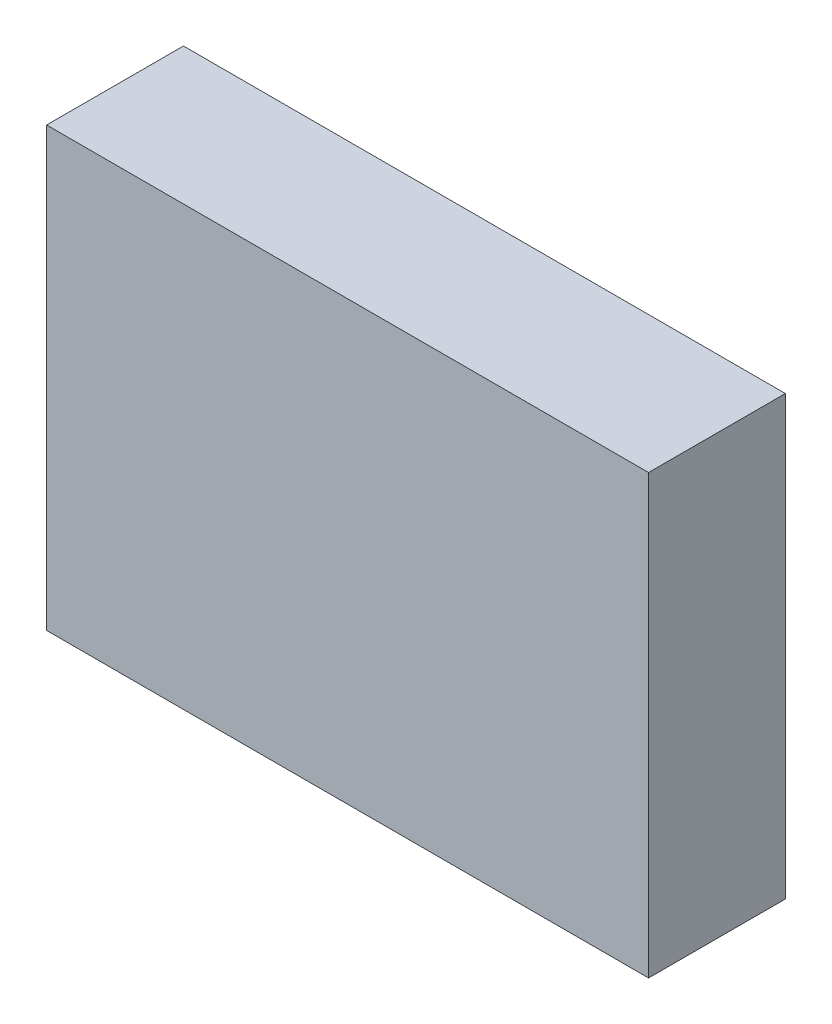
ISO-10303-21;
HEADER;
FILE_DESCRIPTION(('STEP AP214'),'2;1');
FILE_NAME('part.step','',(''),(''),'','','');
FILE_SCHEMA(('AUTOMOTIVE_DESIGN { 1 0 10303 214 1 1 1 1 }'));
ENDSEC;
DATA;
#1=APPLICATION_CONTEXT('core data for automotive mechanical design processes');
#2=APPLICATION_PROTOCOL_DEFINITION('international standard','automotive_design',2000,#1);
#3=PRODUCT_CONTEXT('',#1,'mechanical');
#4=PRODUCT('Part','Part','',(#3));
#5=PRODUCT_RELATED_PRODUCT_CATEGORY('part','',(#4));
#6=PRODUCT_DEFINITION_FORMATION('','',#4);
#7=PRODUCT_DEFINITION_CONTEXT('part definition',#1,'design');
#8=PRODUCT_DEFINITION('design','',#6,#7);
#9=PRODUCT_DEFINITION_SHAPE('','',#8);
#10=(LENGTH_UNIT() NAMED_UNIT(*) SI_UNIT(.MILLI.,.METRE.));
#11=(NAMED_UNIT(*) PLANE_ANGLE_UNIT() SI_UNIT($,.RADIAN.));
#12=(NAMED_UNIT(*) SI_UNIT($,.STERADIAN.) SOLID_ANGLE_UNIT());
#13=UNCERTAINTY_MEASURE_WITH_UNIT(LENGTH_MEASURE(1.E-05),#10,'distance_accuracy_value','');
#14=(GEOMETRIC_REPRESENTATION_CONTEXT(3) GLOBAL_UNCERTAINTY_ASSIGNED_CONTEXT((#13)) GLOBAL_UNIT_ASSIGNED_CONTEXT((#10,
#11,#12)) REPRESENTATION_CONTEXT('',''));
#15=CARTESIAN_POINT('',(0.,0.,0.));
#16=DIRECTION('',(0.,0.,1.));
#17=DIRECTION('',(1.,0.,0.));
#18=AXIS2_PLACEMENT_3D('',#15,#16,#17);
#19=CARTESIAN_POINT('',(-1.10000034,0.80000094,0.499999));
#20=DIRECTION('',(0.,0.,-1.));
#21=DIRECTION('',(-1.,0.,0.));
#22=AXIS2_PLACEMENT_3D('',#19,#20,#21);
#23=PLANE('',#22);
#24=DIRECTION('',(1.,0.,0.));
#25=VECTOR('',#24,1.);
#26=CARTESIAN_POINT('',(-1.10000034,-0.80000094,0.499999));
#27=LINE('',#26,#25);
#28=CARTESIAN_POINT('',(-1.10000034,-0.80000094,0.499999));
#29=VERTEX_POINT('',#28);
#30=CARTESIAN_POINT('',(1.10000034,-0.80000094,0.499999));
#31=VERTEX_POINT('',#30);
#32=EDGE_CURVE('E54',#29,#31,#27,.T.);
#33=ORIENTED_EDGE('',*,*,#32,.T.);
#34=DIRECTION('',(0.,1.,0.));
#35=VECTOR('',#34,1.);
#36=CARTESIAN_POINT('',(1.10000034,-0.80000094,0.499999));
#37=LINE('',#36,#35);
#38=CARTESIAN_POINT('',(1.10000034,0.80000094,0.499999));
#39=VERTEX_POINT('',#38);
#40=EDGE_CURVE('E57',#31,#39,#37,.T.);
#41=ORIENTED_EDGE('',*,*,#40,.T.);
#42=DIRECTION('',(1.,0.,0.));
#43=VECTOR('',#42,1.);
#44=CARTESIAN_POINT('',(1.10000034,0.80000094,0.499999));
#45=LINE('',#44,#43);
#46=CARTESIAN_POINT('',(-1.10000034,0.80000094,0.499999));
#47=VERTEX_POINT('',#46);
#48=EDGE_CURVE('E59',#39,#47,#45,.F.);
#49=ORIENTED_EDGE('',*,*,#48,.T.);
#50=DIRECTION('',(0.,1.,0.));
#51=VECTOR('',#50,1.);
#52=CARTESIAN_POINT('',(-1.10000034,0.80000094,0.499999));
#53=LINE('',#52,#51);
#54=EDGE_CURVE('E19',#29,#47,#53,.T.);
#55=ORIENTED_EDGE('',*,*,#54,.F.);
#56=EDGE_LOOP('',(#33,#41,#49,#55));
#57=FACE_BOUND('',#56,.T.);
#58=ADVANCED_FACE('F16',(#57),#23,.F.);
#59=CARTESIAN_POINT('',(1.10000034,0.80000094,0.));
#60=DIRECTION('',(0.,-1.,0.));
#61=DIRECTION('',(0.,0.,-1.));
#62=AXIS2_PLACEMENT_3D('',#59,#60,#61);
#63=PLANE('',#62);
#64=DIRECTION('',(0.,0.,-1.));
#65=VECTOR('',#64,1.);
#66=CARTESIAN_POINT('',(-1.10000034,0.80000094,0.));
#67=LINE('',#66,#65);
#68=CARTESIAN_POINT('',(-1.10000034,0.80000094,0.));
#69=VERTEX_POINT('',#68);
#70=EDGE_CURVE('E70',#69,#47,#67,.F.);
#71=ORIENTED_EDGE('',*,*,#70,.T.);
#72=ORIENTED_EDGE('',*,*,#48,.F.);
#73=DIRECTION('',(0.,0.,1.));
#74=VECTOR('',#73,1.);
#75=CARTESIAN_POINT('',(1.10000034,0.80000094,0.));
#76=LINE('',#75,#74);
#77=CARTESIAN_POINT('',(1.10000034,0.80000094,0.));
#78=VERTEX_POINT('',#77);
#79=EDGE_CURVE('E64',#39,#78,#76,.F.);
#80=ORIENTED_EDGE('',*,*,#79,.T.);
#81=DIRECTION('',(-1.,0.,0.));
#82=VECTOR('',#81,1.);
#83=CARTESIAN_POINT('',(-1.10000034,0.80000094,0.));
#84=LINE('',#83,#82);
#85=EDGE_CURVE('E82',#69,#78,#84,.F.);
#86=ORIENTED_EDGE('',*,*,#85,.F.);
#87=EDGE_LOOP('',(#71,#72,#80,#86));
#88=FACE_BOUND('',#87,.T.);
#89=ADVANCED_FACE('F67',(#88),#63,.F.);
#90=CARTESIAN_POINT('',(1.10000034,-0.80000094,0.));
#91=DIRECTION('',(-1.,0.,0.));
#92=DIRECTION('',(0.,0.,1.));
#93=AXIS2_PLACEMENT_3D('',#90,#91,#92);
#94=PLANE('',#93);
#95=ORIENTED_EDGE('',*,*,#79,.F.);
#96=ORIENTED_EDGE('',*,*,#40,.F.);
#97=DIRECTION('',(0.,0.,1.));
#98=VECTOR('',#97,1.);
#99=CARTESIAN_POINT('',(1.10000034,-0.80000094,0.));
#100=LINE('',#99,#98);
#101=CARTESIAN_POINT('',(1.10000034,-0.80000094,0.));
#102=VERTEX_POINT('',#101);
#103=EDGE_CURVE('E76',#31,#102,#100,.F.);
#104=ORIENTED_EDGE('',*,*,#103,.T.);
#105=DIRECTION('',(0.,1.,0.));
#106=VECTOR('',#105,1.);
#107=CARTESIAN_POINT('',(1.10000034,0.80000094,0.));
#108=LINE('',#107,#106);
#109=EDGE_CURVE('E73',#78,#102,#108,.F.);
#110=ORIENTED_EDGE('',*,*,#109,.F.);
#111=EDGE_LOOP('',(#95,#96,#104,#110));
#112=FACE_BOUND('',#111,.T.);
#113=ADVANCED_FACE('F71',(#112),#94,.F.);
#114=CARTESIAN_POINT('',(-1.10000034,-0.80000094,0.));
#115=DIRECTION('',(0.,1.,0.));
#116=DIRECTION('',(0.,0.,1.));
#117=AXIS2_PLACEMENT_3D('',#114,#115,#116);
#118=PLANE('',#117);
#119=ORIENTED_EDGE('',*,*,#103,.F.);
#120=ORIENTED_EDGE('',*,*,#32,.F.);
#121=DIRECTION('',(0.,0.,-1.));
#122=VECTOR('',#121,1.);
#123=CARTESIAN_POINT('',(-1.10000034,-0.80000094,0.));
#124=LINE('',#123,#122);
#125=CARTESIAN_POINT('',(-1.10000034,-0.80000094,0.));
#126=VERTEX_POINT('',#125);
#127=EDGE_CURVE('E34',#29,#126,#124,.T.);
#128=ORIENTED_EDGE('',*,*,#127,.T.);
#129=DIRECTION('',(-1.,0.,0.));
#130=VECTOR('',#129,1.);
#131=CARTESIAN_POINT('',(-1.10000034,-0.80000094,0.));
#132=LINE('',#131,#130);
#133=EDGE_CURVE('E25',#102,#126,#132,.T.);
#134=ORIENTED_EDGE('',*,*,#133,.F.);
#135=EDGE_LOOP('',(#119,#120,#128,#134));
#136=FACE_BOUND('',#135,.T.);
#137=ADVANCED_FACE('F88',(#136),#118,.F.);
#138=CARTESIAN_POINT('',(-1.10000034,0.80000094,0.));
#139=DIRECTION('',(1.,0.,0.));
#140=DIRECTION('',(0.,0.,-1.));
#141=AXIS2_PLACEMENT_3D('',#138,#139,#140);
#142=PLANE('',#141);
#143=ORIENTED_EDGE('',*,*,#127,.F.);
#144=ORIENTED_EDGE('',*,*,#54,.T.);
#145=ORIENTED_EDGE('',*,*,#70,.F.);
#146=DIRECTION('',(0.,1.,0.));
#147=VECTOR('',#146,1.);
#148=CARTESIAN_POINT('',(-1.10000034,0.80000094,0.));
#149=LINE('',#148,#147);
#150=EDGE_CURVE('E11',#126,#69,#149,.T.);
#151=ORIENTED_EDGE('',*,*,#150,.F.);
#152=EDGE_LOOP('',(#143,#144,#145,#151));
#153=FACE_BOUND('',#152,.T.);
#154=ADVANCED_FACE('F90',(#153),#142,.F.);
#155=CARTESIAN_POINT('',(-1.10000034,0.80000094,0.));
#156=DIRECTION('',(0.,0.,-1.));
#157=DIRECTION('',(-1.,0.,0.));
#158=AXIS2_PLACEMENT_3D('',#155,#156,#157);
#159=PLANE('',#158);
#160=ORIENTED_EDGE('',*,*,#133,.T.);
#161=ORIENTED_EDGE('',*,*,#150,.T.);
#162=ORIENTED_EDGE('',*,*,#85,.T.);
#163=ORIENTED_EDGE('',*,*,#109,.T.);
#164=EDGE_LOOP('',(#160,#161,#162,#163));
#165=FACE_BOUND('',#164,.T.);
#166=ADVANCED_FACE('F87',(#165),#159,.T.);
#167=CLOSED_SHELL('',(#58,#89,#113,#137,#154,#166));
#168=MANIFOLD_SOLID_BREP('B1',#167);
#169=ADVANCED_BREP_SHAPE_REPRESENTATION('',(#18,#168),#14);
#170=SHAPE_DEFINITION_REPRESENTATION(#9,#169);
ENDSEC;
END-ISO-10303-21;
